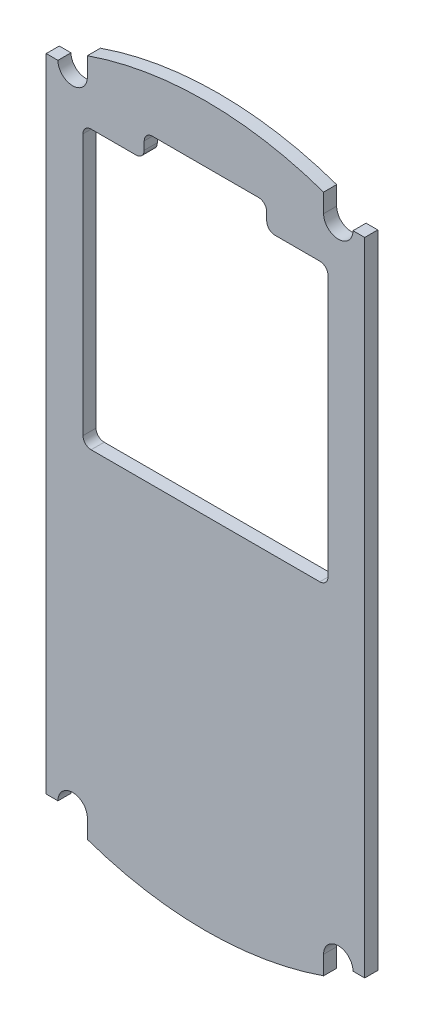
ISO-10303-21;
HEADER;
FILE_DESCRIPTION(('STEP AP214'),'2;1');
FILE_NAME('part.step','',(''),(''),'','','');
FILE_SCHEMA(('AUTOMOTIVE_DESIGN { 1 0 10303 214 1 1 1 1 }'));
ENDSEC;
DATA;
#1=APPLICATION_CONTEXT('core data for automotive mechanical design processes');
#2=APPLICATION_PROTOCOL_DEFINITION('international standard','automotive_design',2000,#1);
#3=PRODUCT_CONTEXT('',#1,'mechanical');
#4=PRODUCT('Part','Part','',(#3));
#5=PRODUCT_RELATED_PRODUCT_CATEGORY('part','',(#4));
#6=PRODUCT_DEFINITION_FORMATION('','',#4);
#7=PRODUCT_DEFINITION_CONTEXT('part definition',#1,'design');
#8=PRODUCT_DEFINITION('design','',#6,#7);
#9=PRODUCT_DEFINITION_SHAPE('','',#8);
#10=(LENGTH_UNIT() NAMED_UNIT(*) SI_UNIT(.MILLI.,.METRE.));
#11=(NAMED_UNIT(*) PLANE_ANGLE_UNIT() SI_UNIT($,.RADIAN.));
#12=(NAMED_UNIT(*) SI_UNIT($,.STERADIAN.) SOLID_ANGLE_UNIT());
#13=UNCERTAINTY_MEASURE_WITH_UNIT(LENGTH_MEASURE(1.E-05),#10,'distance_accuracy_value','');
#14=(GEOMETRIC_REPRESENTATION_CONTEXT(3) GLOBAL_UNCERTAINTY_ASSIGNED_CONTEXT((#13)) GLOBAL_UNIT_ASSIGNED_CONTEXT((#10,
#11,#12)) REPRESENTATION_CONTEXT('',''));
#15=CARTESIAN_POINT('',(0.,0.,0.));
#16=DIRECTION('',(0.,0.,1.));
#17=DIRECTION('',(1.,0.,0.));
#18=AXIS2_PLACEMENT_3D('',#15,#16,#17);
#19=CARTESIAN_POINT('',(19.5,0.,1.6));
#20=DIRECTION('',(-1.,0.,0.));
#21=DIRECTION('',(0.,0.,1.));
#22=AXIS2_PLACEMENT_3D('',#19,#20,#21);
#23=PLANE('',#22);
#24=DIRECTION('',(0.,1.,0.));
#25=VECTOR('',#24,1.);
#26=CARTESIAN_POINT('',(19.5,0.,0.));
#27=LINE('',#26,#25);
#28=CARTESIAN_POINT('',(19.5,-39.2648801317297,0.));
#29=VERTEX_POINT('',#28);
#30=CARTESIAN_POINT('',(19.5,39.2648801317297,0.));
#31=VERTEX_POINT('',#30);
#32=EDGE_CURVE('E267',#29,#31,#27,.T.);
#33=ORIENTED_EDGE('',*,*,#32,.T.);
#34=DIRECTION('',(0.,0.,-1.));
#35=VECTOR('',#34,1.);
#36=CARTESIAN_POINT('',(19.5,39.2648801317297,1.6));
#37=LINE('',#36,#35);
#38=CARTESIAN_POINT('',(19.5,39.2648801317297,1.6));
#39=VERTEX_POINT('',#38);
#40=EDGE_CURVE('E266',#39,#31,#37,.T.);
#41=ORIENTED_EDGE('',*,*,#40,.F.);
#42=DIRECTION('',(0.,1.,0.));
#43=VECTOR('',#42,1.);
#44=CARTESIAN_POINT('',(19.5,0.,1.6));
#45=LINE('',#44,#43);
#46=CARTESIAN_POINT('',(19.5,-39.2648801317297,1.6));
#47=VERTEX_POINT('',#46);
#48=EDGE_CURVE('E251',#47,#39,#45,.T.);
#49=ORIENTED_EDGE('',*,*,#48,.F.);
#50=DIRECTION('',(0.,0.,-1.));
#51=VECTOR('',#50,1.);
#52=CARTESIAN_POINT('',(19.5,-39.2648801317297,1.6));
#53=LINE('',#52,#51);
#54=EDGE_CURVE('E325',#47,#29,#53,.T.);
#55=ORIENTED_EDGE('',*,*,#54,.T.);
#56=EDGE_LOOP('',(#33,#41,#49,#55));
#57=FACE_BOUND('',#56,.T.);
#58=ADVANCED_FACE('F42',(#57),#23,.F.);
#59=CARTESIAN_POINT('',(18.0640458755163,39.2648801317297,1.6));
#60=DIRECTION('',(0.,-1.,0.));
#61=DIRECTION('',(1.,0.,0.));
#62=AXIS2_PLACEMENT_3D('',#59,#60,#61);
#63=PLANE('',#62);
#64=DIRECTION('',(-1.,0.,0.));
#65=VECTOR('',#64,1.);
#66=CARTESIAN_POINT('',(18.0640458755163,39.2648801317297,0.));
#67=LINE('',#66,#65);
#68=CARTESIAN_POINT('',(18.0640458755163,39.2648801317297,0.));
#69=VERTEX_POINT('',#68);
#70=EDGE_CURVE('E328',#31,#69,#67,.T.);
#71=ORIENTED_EDGE('',*,*,#70,.T.);
#72=DIRECTION('',(0.,0.,-1.));
#73=VECTOR('',#72,1.);
#74=CARTESIAN_POINT('',(18.0640458755163,39.2648801317297,1.6));
#75=LINE('',#74,#73);
#76=CARTESIAN_POINT('',(18.0640458755163,39.2648801317297,1.6));
#77=VERTEX_POINT('',#76);
#78=EDGE_CURVE('E272',#77,#69,#75,.T.);
#79=ORIENTED_EDGE('',*,*,#78,.F.);
#80=DIRECTION('',(-1.,0.,0.));
#81=VECTOR('',#80,1.);
#82=CARTESIAN_POINT('',(18.0640458755163,39.2648801317297,1.6));
#83=LINE('',#82,#81);
#84=EDGE_CURVE('E255',#39,#77,#83,.T.);
#85=ORIENTED_EDGE('',*,*,#84,.F.);
#86=ORIENTED_EDGE('',*,*,#40,.T.);
#87=EDGE_LOOP('',(#71,#79,#85,#86));
#88=FACE_BOUND('',#87,.T.);
#89=ADVANCED_FACE('F274',(#88),#63,.F.);
#90=CARTESIAN_POINT('',(16.2640458755163,39.2648801317297,1.6));
#91=DIRECTION('',(0.,0.,-1.));
#92=DIRECTION('',(-1.,0.,0.));
#93=AXIS2_PLACEMENT_3D('',#90,#91,#92);
#94=CYLINDRICAL_SURFACE('',#93,1.8);
#95=CARTESIAN_POINT('',(16.2640458755163,39.2648801317297,0.));
#96=DIRECTION('',(0.,0.,-1.));
#97=DIRECTION('',(-1.,0.,0.));
#98=AXIS2_PLACEMENT_3D('',#95,#96,#97);
#99=CIRCLE('',#98,1.8);
#100=CARTESIAN_POINT('',(14.4640458755163,39.2648801317297,0.));
#101=VERTEX_POINT('',#100);
#102=EDGE_CURVE('E332',#69,#101,#99,.T.);
#103=ORIENTED_EDGE('',*,*,#102,.T.);
#104=DIRECTION('',(0.,0.,-1.));
#105=VECTOR('',#104,1.);
#106=CARTESIAN_POINT('',(14.4640458755163,39.2648801317297,1.6));
#107=LINE('',#106,#105);
#108=CARTESIAN_POINT('',(14.4640458755163,39.2648801317297,1.6));
#109=VERTEX_POINT('',#108);
#110=EDGE_CURVE('E424',#109,#101,#107,.T.);
#111=ORIENTED_EDGE('',*,*,#110,.F.);
#112=CARTESIAN_POINT('',(16.2640458755163,39.2648801317297,1.6));
#113=DIRECTION('',(0.,0.,-1.));
#114=DIRECTION('',(-1.,0.,0.));
#115=AXIS2_PLACEMENT_3D('',#112,#113,#114);
#116=CIRCLE('',#115,1.8);
#117=EDGE_CURVE('E278',#77,#109,#116,.T.);
#118=ORIENTED_EDGE('',*,*,#117,.F.);
#119=ORIENTED_EDGE('',*,*,#78,.T.);
#120=EDGE_LOOP('',(#103,#111,#118,#119));
#121=FACE_BOUND('',#120,.T.);
#122=ADVANCED_FACE('F749',(#121),#94,.F.);
#123=CARTESIAN_POINT('',(14.4640458755163,41.554679362389,1.6));
#124=DIRECTION('',(-1.,0.,0.));
#125=DIRECTION('',(0.,0.,1.));
#126=AXIS2_PLACEMENT_3D('',#123,#124,#125);
#127=PLANE('',#126);
#128=DIRECTION('',(0.,1.,0.));
#129=VECTOR('',#128,1.);
#130=CARTESIAN_POINT('',(14.4640458755163,41.554679362389,0.));
#131=LINE('',#130,#129);
#132=CARTESIAN_POINT('',(14.4640458755163,41.554679362389,0.));
#133=VERTEX_POINT('',#132);
#134=EDGE_CURVE('E335',#101,#133,#131,.T.);
#135=ORIENTED_EDGE('',*,*,#134,.T.);
#136=DIRECTION('',(0.,0.,-1.));
#137=VECTOR('',#136,1.);
#138=CARTESIAN_POINT('',(14.4640458755163,41.554679362389,1.6));
#139=LINE('',#138,#137);
#140=CARTESIAN_POINT('',(14.4640458755163,41.554679362389,1.6));
#141=VERTEX_POINT('',#140);
#142=EDGE_CURVE('E420',#141,#133,#139,.T.);
#143=ORIENTED_EDGE('',*,*,#142,.F.);
#144=DIRECTION('',(0.,1.,0.));
#145=VECTOR('',#144,1.);
#146=CARTESIAN_POINT('',(14.4640458755163,41.554679362389,1.6));
#147=LINE('',#146,#145);
#148=EDGE_CURVE('E284',#109,#141,#147,.T.);
#149=ORIENTED_EDGE('',*,*,#148,.F.);
#150=ORIENTED_EDGE('',*,*,#110,.T.);
#151=EDGE_LOOP('',(#135,#143,#149,#150));
#152=FACE_BOUND('',#151,.T.);
#153=ADVANCED_FACE('F1023',(#152),#127,.F.);
#154=CARTESIAN_POINT('',(0.,0.,1.6));
#155=DIRECTION('',(0.,0.,-1.));
#156=DIRECTION('',(-1.,0.,0.));
#157=AXIS2_PLACEMENT_3D('',#154,#155,#156);
#158=CYLINDRICAL_SURFACE('',#157,44.);
#159=CARTESIAN_POINT('',(0.,0.,0.));
#160=DIRECTION('',(0.,0.,1.));
#161=DIRECTION('',(1.,0.,0.));
#162=AXIS2_PLACEMENT_3D('',#159,#160,#161);
#163=CIRCLE('',#162,44.);
#164=CARTESIAN_POINT('',(-14.4640458755163,41.554679362389,0.));
#165=VERTEX_POINT('',#164);
#166=EDGE_CURVE('E338',#133,#165,#163,.T.);
#167=ORIENTED_EDGE('',*,*,#166,.T.);
#168=DIRECTION('',(0.,0.,-1.));
#169=VECTOR('',#168,1.);
#170=CARTESIAN_POINT('',(-14.4640458755163,41.554679362389,1.6));
#171=LINE('',#170,#169);
#172=CARTESIAN_POINT('',(-14.4640458755163,41.554679362389,1.6));
#173=VERTEX_POINT('',#172);
#174=EDGE_CURVE('E417',#173,#165,#171,.T.);
#175=ORIENTED_EDGE('',*,*,#174,.F.);
#176=CARTESIAN_POINT('',(0.,0.,1.6));
#177=DIRECTION('',(0.,0.,1.));
#178=DIRECTION('',(1.,0.,0.));
#179=AXIS2_PLACEMENT_3D('',#176,#177,#178);
#180=CIRCLE('',#179,44.);
#181=EDGE_CURVE('E290',#141,#173,#180,.T.);
#182=ORIENTED_EDGE('',*,*,#181,.F.);
#183=ORIENTED_EDGE('',*,*,#142,.T.);
#184=EDGE_LOOP('',(#167,#175,#182,#183));
#185=FACE_BOUND('',#184,.T.);
#186=ADVANCED_FACE('F1012',(#185),#158,.T.);
#187=CARTESIAN_POINT('',(-14.4640458755163,41.554679362389,1.6));
#188=DIRECTION('',(1.,0.,0.));
#189=DIRECTION('',(0.,0.,-1.));
#190=AXIS2_PLACEMENT_3D('',#187,#188,#189);
#191=PLANE('',#190);
#192=DIRECTION('',(0.,-1.,0.));
#193=VECTOR('',#192,1.);
#194=CARTESIAN_POINT('',(-14.4640458755163,41.554679362389,0.));
#195=LINE('',#194,#193);
#196=CARTESIAN_POINT('',(-14.4640458755163,39.2648801317297,0.));
#197=VERTEX_POINT('',#196);
#198=EDGE_CURVE('E341',#165,#197,#195,.T.);
#199=ORIENTED_EDGE('',*,*,#198,.T.);
#200=DIRECTION('',(0.,0.,-1.));
#201=VECTOR('',#200,1.);
#202=CARTESIAN_POINT('',(-14.4640458755163,39.2648801317297,1.6));
#203=LINE('',#202,#201);
#204=CARTESIAN_POINT('',(-14.4640458755163,39.2648801317297,1.6));
#205=VERTEX_POINT('',#204);
#206=EDGE_CURVE('E413',#205,#197,#203,.T.);
#207=ORIENTED_EDGE('',*,*,#206,.F.);
#208=DIRECTION('',(0.,-1.,0.));
#209=VECTOR('',#208,1.);
#210=CARTESIAN_POINT('',(-14.4640458755163,41.554679362389,1.6));
#211=LINE('',#210,#209);
#212=EDGE_CURVE('E293',#173,#205,#211,.T.);
#213=ORIENTED_EDGE('',*,*,#212,.F.);
#214=ORIENTED_EDGE('',*,*,#174,.T.);
#215=EDGE_LOOP('',(#199,#207,#213,#214));
#216=FACE_BOUND('',#215,.T.);
#217=ADVANCED_FACE('F1001',(#216),#191,.F.);
#218=CARTESIAN_POINT('',(-16.2640458755163,39.2648801317297,1.6));
#219=DIRECTION('',(0.,0.,-1.));
#220=DIRECTION('',(-1.,0.,0.));
#221=AXIS2_PLACEMENT_3D('',#218,#219,#220);
#222=CYLINDRICAL_SURFACE('',#221,1.8);
#223=CARTESIAN_POINT('',(-16.2640458755163,39.2648801317297,0.));
#224=DIRECTION('',(0.,0.,-1.));
#225=DIRECTION('',(1.,0.,0.));
#226=AXIS2_PLACEMENT_3D('',#223,#224,#225);
#227=CIRCLE('',#226,1.8);
#228=CARTESIAN_POINT('',(-18.0640458755163,39.2648801317297,0.));
#229=VERTEX_POINT('',#228);
#230=EDGE_CURVE('E344',#197,#229,#227,.T.);
#231=ORIENTED_EDGE('',*,*,#230,.T.);
#232=DIRECTION('',(0.,0.,-1.));
#233=VECTOR('',#232,1.);
#234=CARTESIAN_POINT('',(-18.0640458755163,39.2648801317297,1.6));
#235=LINE('',#234,#233);
#236=CARTESIAN_POINT('',(-18.0640458755163,39.2648801317297,1.6));
#237=VERTEX_POINT('',#236);
#238=EDGE_CURVE('E409',#237,#229,#235,.T.);
#239=ORIENTED_EDGE('',*,*,#238,.F.);
#240=CARTESIAN_POINT('',(-16.2640458755163,39.2648801317297,1.6));
#241=DIRECTION('',(0.,0.,-1.));
#242=DIRECTION('',(1.,0.,0.));
#243=AXIS2_PLACEMENT_3D('',#240,#241,#242);
#244=CIRCLE('',#243,1.8);
#245=EDGE_CURVE('E296',#205,#237,#244,.T.);
#246=ORIENTED_EDGE('',*,*,#245,.F.);
#247=ORIENTED_EDGE('',*,*,#206,.T.);
#248=EDGE_LOOP('',(#231,#239,#246,#247));
#249=FACE_BOUND('',#248,.T.);
#250=ADVANCED_FACE('F990',(#249),#222,.F.);
#251=CARTESIAN_POINT('',(-18.0640458755163,39.2648801317297,1.6));
#252=DIRECTION('',(0.,-1.,0.));
#253=DIRECTION('',(1.,0.,0.));
#254=AXIS2_PLACEMENT_3D('',#251,#252,#253);
#255=PLANE('',#254);
#256=DIRECTION('',(-1.,0.,0.));
#257=VECTOR('',#256,1.);
#258=CARTESIAN_POINT('',(-18.0640458755163,39.2648801317297,0.));
#259=LINE('',#258,#257);
#260=CARTESIAN_POINT('',(-19.5,39.2648801317297,0.));
#261=VERTEX_POINT('',#260);
#262=EDGE_CURVE('E347',#229,#261,#259,.T.);
#263=ORIENTED_EDGE('',*,*,#262,.T.);
#264=DIRECTION('',(0.,0.,-1.));
#265=VECTOR('',#264,1.);
#266=CARTESIAN_POINT('',(-19.5,39.2648801317297,1.6));
#267=LINE('',#266,#265);
#268=CARTESIAN_POINT('',(-19.5,39.2648801317297,1.6));
#269=VERTEX_POINT('',#268);
#270=EDGE_CURVE('E405',#269,#261,#267,.T.);
#271=ORIENTED_EDGE('',*,*,#270,.F.);
#272=DIRECTION('',(-1.,0.,0.));
#273=VECTOR('',#272,1.);
#274=CARTESIAN_POINT('',(-18.0640458755163,39.2648801317297,1.6));
#275=LINE('',#274,#273);
#276=EDGE_CURVE('E299',#237,#269,#275,.T.);
#277=ORIENTED_EDGE('',*,*,#276,.F.);
#278=ORIENTED_EDGE('',*,*,#238,.T.);
#279=EDGE_LOOP('',(#263,#271,#277,#278));
#280=FACE_BOUND('',#279,.T.);
#281=ADVANCED_FACE('F976',(#280),#255,.F.);
#282=CARTESIAN_POINT('',(-19.5,0.,1.6));
#283=DIRECTION('',(1.,0.,0.));
#284=DIRECTION('',(0.,1.,0.));
#285=AXIS2_PLACEMENT_3D('',#282,#283,#284);
#286=PLANE('',#285);
#287=DIRECTION('',(0.,-1.,0.));
#288=VECTOR('',#287,1.);
#289=CARTESIAN_POINT('',(-19.5,0.,0.));
#290=LINE('',#289,#288);
#291=CARTESIAN_POINT('',(-19.5,-39.2648801317297,0.));
#292=VERTEX_POINT('',#291);
#293=EDGE_CURVE('E351',#261,#292,#290,.T.);
#294=ORIENTED_EDGE('',*,*,#293,.T.);
#295=DIRECTION('',(0.,0.,-1.));
#296=VECTOR('',#295,1.);
#297=CARTESIAN_POINT('',(-19.5,-39.2648801317297,1.6));
#298=LINE('',#297,#296);
#299=CARTESIAN_POINT('',(-19.5,-39.2648801317297,1.6));
#300=VERTEX_POINT('',#299);
#301=EDGE_CURVE('E401',#300,#292,#298,.T.);
#302=ORIENTED_EDGE('',*,*,#301,.F.);
#303=DIRECTION('',(0.,-1.,0.));
#304=VECTOR('',#303,1.);
#305=CARTESIAN_POINT('',(-19.5,0.,1.6));
#306=LINE('',#305,#304);
#307=EDGE_CURVE('E302',#269,#300,#306,.T.);
#308=ORIENTED_EDGE('',*,*,#307,.F.);
#309=ORIENTED_EDGE('',*,*,#270,.T.);
#310=EDGE_LOOP('',(#294,#302,#308,#309));
#311=FACE_BOUND('',#310,.T.);
#312=ADVANCED_FACE('F966',(#311),#286,.F.);
#313=CARTESIAN_POINT('',(-18.0640458755163,-39.2648801317297,1.6));
#314=DIRECTION('',(0.,1.,0.));
#315=DIRECTION('',(-1.,0.,0.));
#316=AXIS2_PLACEMENT_3D('',#313,#314,#315);
#317=PLANE('',#316);
#318=DIRECTION('',(1.,0.,0.));
#319=VECTOR('',#318,1.);
#320=CARTESIAN_POINT('',(-18.0640458755163,-39.2648801317297,0.));
#321=LINE('',#320,#319);
#322=CARTESIAN_POINT('',(-18.0640458755163,-39.2648801317297,0.));
#323=VERTEX_POINT('',#322);
#324=EDGE_CURVE('E354',#292,#323,#321,.T.);
#325=ORIENTED_EDGE('',*,*,#324,.T.);
#326=DIRECTION('',(0.,0.,-1.));
#327=VECTOR('',#326,1.);
#328=CARTESIAN_POINT('',(-18.0640458755163,-39.2648801317297,1.6));
#329=LINE('',#328,#327);
#330=CARTESIAN_POINT('',(-18.0640458755163,-39.2648801317297,1.6));
#331=VERTEX_POINT('',#330);
#332=EDGE_CURVE('E397',#331,#323,#329,.T.);
#333=ORIENTED_EDGE('',*,*,#332,.F.);
#334=DIRECTION('',(1.,0.,0.));
#335=VECTOR('',#334,1.);
#336=CARTESIAN_POINT('',(-18.0640458755163,-39.2648801317297,1.6));
#337=LINE('',#336,#335);
#338=EDGE_CURVE('E305',#300,#331,#337,.T.);
#339=ORIENTED_EDGE('',*,*,#338,.F.);
#340=ORIENTED_EDGE('',*,*,#301,.T.);
#341=EDGE_LOOP('',(#325,#333,#339,#340));
#342=FACE_BOUND('',#341,.T.);
#343=ADVANCED_FACE('F956',(#342),#317,.F.);
#344=CARTESIAN_POINT('',(-16.2640458755163,-39.2648801317297,1.6));
#345=DIRECTION('',(0.,0.,-1.));
#346=DIRECTION('',(-1.,0.,0.));
#347=AXIS2_PLACEMENT_3D('',#344,#345,#346);
#348=CYLINDRICAL_SURFACE('',#347,1.8);
#349=CARTESIAN_POINT('',(-16.2640458755163,-39.2648801317297,0.));
#350=DIRECTION('',(0.,0.,-1.));
#351=DIRECTION('',(-1.,0.,0.));
#352=AXIS2_PLACEMENT_3D('',#349,#350,#351);
#353=CIRCLE('',#352,1.8);
#354=CARTESIAN_POINT('',(-14.4640458755163,-39.2648801317297,0.));
#355=VERTEX_POINT('',#354);
#356=EDGE_CURVE('E357',#323,#355,#353,.T.);
#357=ORIENTED_EDGE('',*,*,#356,.T.);
#358=DIRECTION('',(0.,0.,-1.));
#359=VECTOR('',#358,1.);
#360=CARTESIAN_POINT('',(-14.4640458755163,-39.2648801317297,1.6));
#361=LINE('',#360,#359);
#362=CARTESIAN_POINT('',(-14.4640458755163,-39.2648801317297,1.6));
#363=VERTEX_POINT('',#362);
#364=EDGE_CURVE('E393',#363,#355,#361,.T.);
#365=ORIENTED_EDGE('',*,*,#364,.F.);
#366=CARTESIAN_POINT('',(-16.2640458755163,-39.2648801317297,1.6));
#367=DIRECTION('',(0.,0.,-1.));
#368=DIRECTION('',(-1.,0.,0.));
#369=AXIS2_PLACEMENT_3D('',#366,#367,#368);
#370=CIRCLE('',#369,1.8);
#371=EDGE_CURVE('E308',#331,#363,#370,.T.);
#372=ORIENTED_EDGE('',*,*,#371,.F.);
#373=ORIENTED_EDGE('',*,*,#332,.T.);
#374=EDGE_LOOP('',(#357,#365,#372,#373));
#375=FACE_BOUND('',#374,.T.);
#376=ADVANCED_FACE('F946',(#375),#348,.F.);
#377=CARTESIAN_POINT('',(-14.4640458755163,-41.554679362389,1.6));
#378=DIRECTION('',(1.,0.,0.));
#379=DIRECTION('',(0.,0.,-1.));
#380=AXIS2_PLACEMENT_3D('',#377,#378,#379);
#381=PLANE('',#380);
#382=DIRECTION('',(0.,-1.,0.));
#383=VECTOR('',#382,1.);
#384=CARTESIAN_POINT('',(-14.4640458755163,-41.554679362389,0.));
#385=LINE('',#384,#383);
#386=CARTESIAN_POINT('',(-14.4640458755163,-41.554679362389,0.));
#387=VERTEX_POINT('',#386);
#388=EDGE_CURVE('E360',#355,#387,#385,.T.);
#389=ORIENTED_EDGE('',*,*,#388,.T.);
#390=DIRECTION('',(0.,0.,-1.));
#391=VECTOR('',#390,1.);
#392=CARTESIAN_POINT('',(-14.4640458755163,-41.554679362389,1.6));
#393=LINE('',#392,#391);
#394=CARTESIAN_POINT('',(-14.4640458755163,-41.554679362389,1.6));
#395=VERTEX_POINT('',#394);
#396=EDGE_CURVE('E389',#395,#387,#393,.T.);
#397=ORIENTED_EDGE('',*,*,#396,.F.);
#398=DIRECTION('',(0.,-1.,0.));
#399=VECTOR('',#398,1.);
#400=CARTESIAN_POINT('',(-14.4640458755163,-41.554679362389,1.6));
#401=LINE('',#400,#399);
#402=EDGE_CURVE('E311',#363,#395,#401,.T.);
#403=ORIENTED_EDGE('',*,*,#402,.F.);
#404=ORIENTED_EDGE('',*,*,#364,.T.);
#405=EDGE_LOOP('',(#389,#397,#403,#404));
#406=FACE_BOUND('',#405,.T.);
#407=ADVANCED_FACE('F936',(#406),#381,.F.);
#408=CARTESIAN_POINT('',(0.,0.,1.6));
#409=DIRECTION('',(0.,0.,-1.));
#410=DIRECTION('',(-1.,0.,0.));
#411=AXIS2_PLACEMENT_3D('',#408,#409,#410);
#412=CYLINDRICAL_SURFACE('',#411,44.);
#413=CARTESIAN_POINT('',(0.,0.,0.));
#414=DIRECTION('',(0.,0.,1.));
#415=DIRECTION('',(-1.,0.,0.));
#416=AXIS2_PLACEMENT_3D('',#413,#414,#415);
#417=CIRCLE('',#416,44.);
#418=CARTESIAN_POINT('',(14.4640458755164,-41.554679362389,0.));
#419=VERTEX_POINT('',#418);
#420=EDGE_CURVE('E363',#387,#419,#417,.T.);
#421=ORIENTED_EDGE('',*,*,#420,.T.);
#422=DIRECTION('',(0.,0.,-1.));
#423=VECTOR('',#422,1.);
#424=CARTESIAN_POINT('',(14.4640458755164,-41.554679362389,1.6));
#425=LINE('',#424,#423);
#426=CARTESIAN_POINT('',(14.4640458755164,-41.554679362389,1.6));
#427=VERTEX_POINT('',#426);
#428=EDGE_CURVE('E385',#427,#419,#425,.T.);
#429=ORIENTED_EDGE('',*,*,#428,.F.);
#430=CARTESIAN_POINT('',(0.,0.,1.6));
#431=DIRECTION('',(0.,0.,1.));
#432=DIRECTION('',(-1.,0.,0.));
#433=AXIS2_PLACEMENT_3D('',#430,#431,#432);
#434=CIRCLE('',#433,44.);
#435=EDGE_CURVE('E314',#395,#427,#434,.T.);
#436=ORIENTED_EDGE('',*,*,#435,.F.);
#437=ORIENTED_EDGE('',*,*,#396,.T.);
#438=EDGE_LOOP('',(#421,#429,#436,#437));
#439=FACE_BOUND('',#438,.T.);
#440=ADVANCED_FACE('F926',(#439),#412,.T.);
#441=CARTESIAN_POINT('',(14.4640458755164,-41.554679362389,1.6));
#442=DIRECTION('',(-1.,0.,0.));
#443=DIRECTION('',(0.,0.,1.));
#444=AXIS2_PLACEMENT_3D('',#441,#442,#443);
#445=PLANE('',#444);
#446=DIRECTION('',(0.,1.,0.));
#447=VECTOR('',#446,1.);
#448=CARTESIAN_POINT('',(14.4640458755164,-41.554679362389,0.));
#449=LINE('',#448,#447);
#450=CARTESIAN_POINT('',(14.4640458755164,-39.2648801317297,0.));
#451=VERTEX_POINT('',#450);
#452=EDGE_CURVE('E366',#419,#451,#449,.T.);
#453=ORIENTED_EDGE('',*,*,#452,.T.);
#454=DIRECTION('',(0.,0.,-1.));
#455=VECTOR('',#454,1.);
#456=CARTESIAN_POINT('',(14.4640458755164,-39.2648801317297,1.6));
#457=LINE('',#456,#455);
#458=CARTESIAN_POINT('',(14.4640458755164,-39.2648801317297,1.6));
#459=VERTEX_POINT('',#458);
#460=EDGE_CURVE('E381',#459,#451,#457,.T.);
#461=ORIENTED_EDGE('',*,*,#460,.F.);
#462=DIRECTION('',(0.,1.,0.));
#463=VECTOR('',#462,1.);
#464=CARTESIAN_POINT('',(14.4640458755164,-41.554679362389,1.6));
#465=LINE('',#464,#463);
#466=EDGE_CURVE('E317',#427,#459,#465,.T.);
#467=ORIENTED_EDGE('',*,*,#466,.F.);
#468=ORIENTED_EDGE('',*,*,#428,.T.);
#469=EDGE_LOOP('',(#453,#461,#467,#468));
#470=FACE_BOUND('',#469,.T.);
#471=ADVANCED_FACE('F916',(#470),#445,.F.);
#472=CARTESIAN_POINT('',(16.2640458755163,-39.2648801317297,1.6));
#473=DIRECTION('',(0.,0.,-1.));
#474=DIRECTION('',(-1.,0.,0.));
#475=AXIS2_PLACEMENT_3D('',#472,#473,#474);
#476=CYLINDRICAL_SURFACE('',#475,1.8);
#477=CARTESIAN_POINT('',(16.2640458755163,-39.2648801317297,0.));
#478=DIRECTION('',(0.,0.,-1.));
#479=DIRECTION('',(1.,0.,0.));
#480=AXIS2_PLACEMENT_3D('',#477,#478,#479);
#481=CIRCLE('',#480,1.8);
#482=CARTESIAN_POINT('',(18.0640458755163,-39.2648801317297,0.));
#483=VERTEX_POINT('',#482);
#484=EDGE_CURVE('E369',#451,#483,#481,.T.);
#485=ORIENTED_EDGE('',*,*,#484,.T.);
#486=DIRECTION('',(0.,0.,-1.));
#487=VECTOR('',#486,1.);
#488=CARTESIAN_POINT('',(18.0640458755163,-39.2648801317297,1.6));
#489=LINE('',#488,#487);
#490=CARTESIAN_POINT('',(18.0640458755163,-39.2648801317297,1.6));
#491=VERTEX_POINT('',#490);
#492=EDGE_CURVE('E377',#491,#483,#489,.T.);
#493=ORIENTED_EDGE('',*,*,#492,.F.);
#494=CARTESIAN_POINT('',(16.2640458755163,-39.2648801317297,1.6));
#495=DIRECTION('',(0.,0.,-1.));
#496=DIRECTION('',(1.,0.,0.));
#497=AXIS2_PLACEMENT_3D('',#494,#495,#496);
#498=CIRCLE('',#497,1.8);
#499=EDGE_CURVE('E320',#459,#491,#498,.T.);
#500=ORIENTED_EDGE('',*,*,#499,.F.);
#501=ORIENTED_EDGE('',*,*,#460,.T.);
#502=EDGE_LOOP('',(#485,#493,#500,#501));
#503=FACE_BOUND('',#502,.T.);
#504=ADVANCED_FACE('F907',(#503),#476,.F.);
#505=CARTESIAN_POINT('',(18.0640458755163,-39.2648801317297,1.6));
#506=DIRECTION('',(0.,1.,0.));
#507=DIRECTION('',(-1.,0.,0.));
#508=AXIS2_PLACEMENT_3D('',#505,#506,#507);
#509=PLANE('',#508);
#510=DIRECTION('',(1.,0.,0.));
#511=VECTOR('',#510,1.);
#512=CARTESIAN_POINT('',(18.0640458755163,-39.2648801317297,0.));
#513=LINE('',#512,#511);
#514=EDGE_CURVE('E263',#483,#29,#513,.T.);
#515=ORIENTED_EDGE('',*,*,#514,.T.);
#516=ORIENTED_EDGE('',*,*,#54,.F.);
#517=DIRECTION('',(1.,0.,0.));
#518=VECTOR('',#517,1.);
#519=CARTESIAN_POINT('',(18.0640458755163,-39.2648801317297,1.6));
#520=LINE('',#519,#518);
#521=EDGE_CURVE('E258',#491,#47,#520,.T.);
#522=ORIENTED_EDGE('',*,*,#521,.F.);
#523=ORIENTED_EDGE('',*,*,#492,.T.);
#524=EDGE_LOOP('',(#515,#516,#522,#523));
#525=FACE_BOUND('',#524,.T.);
#526=ADVANCED_FACE('F897',(#525),#509,.F.);
#527=CARTESIAN_POINT('',(16.2640458755163,-39.2648801317297,1.6));
#528=DIRECTION('',(0.,0.,1.));
#529=DIRECTION('',(1.,0.,0.));
#530=AXIS2_PLACEMENT_3D('',#527,#528,#529);
#531=PLANE('',#530);
#532=DIRECTION('',(0.,1.,0.));
#533=VECTOR('',#532,1.);
#534=CARTESIAN_POINT('',(7.5,34.,1.6));
#535=LINE('',#534,#533);
#536=CARTESIAN_POINT('',(7.5,35.,1.6));
#537=VERTEX_POINT('',#536);
#538=CARTESIAN_POINT('',(7.5,36.,1.6));
#539=VERTEX_POINT('',#538);
#540=EDGE_CURVE('E616',#537,#539,#535,.T.);
#541=ORIENTED_EDGE('',*,*,#540,.F.);
#542=CARTESIAN_POINT('',(8.5,35.,1.6));
#543=DIRECTION('',(0.,0.,1.));
#544=DIRECTION('',(1.,0.,0.));
#545=AXIS2_PLACEMENT_3D('',#542,#543,#544);
#546=CIRCLE('',#545,1.);
#547=CARTESIAN_POINT('',(8.5,34.,1.6));
#548=VERTEX_POINT('',#547);
#549=EDGE_CURVE('E490',#537,#548,#546,.T.);
#550=ORIENTED_EDGE('',*,*,#549,.T.);
#551=DIRECTION('',(-1.,0.,0.));
#552=VECTOR('',#551,1.);
#553=CARTESIAN_POINT('',(7.5,34.,1.6));
#554=LINE('',#553,#552);
#555=CARTESIAN_POINT('',(14.,34.,1.6));
#556=VERTEX_POINT('',#555);
#557=EDGE_CURVE('E329',#556,#548,#554,.T.);
#558=ORIENTED_EDGE('',*,*,#557,.F.);
#559=CARTESIAN_POINT('',(14.,33.,1.6));
#560=DIRECTION('',(0.,0.,1.));
#561=DIRECTION('',(1.,0.,0.));
#562=AXIS2_PLACEMENT_3D('',#559,#560,#561);
#563=CIRCLE('',#562,1.);
#564=CARTESIAN_POINT('',(15.,33.,1.6));
#565=VERTEX_POINT('',#564);
#566=EDGE_CURVE('E531',#556,#565,#563,.F.);
#567=ORIENTED_EDGE('',*,*,#566,.T.);
#568=DIRECTION('',(0.,1.,0.));
#569=VECTOR('',#568,1.);
#570=CARTESIAN_POINT('',(15.,0.,1.6));
#571=LINE('',#570,#569);
#572=CARTESIAN_POINT('',(15.,1.,1.6));
#573=VERTEX_POINT('',#572);
#574=EDGE_CURVE('E589',#573,#565,#571,.T.);
#575=ORIENTED_EDGE('',*,*,#574,.F.);
#576=CARTESIAN_POINT('',(14.,1.,1.6));
#577=DIRECTION('',(0.,0.,1.));
#578=DIRECTION('',(1.,0.,0.));
#579=AXIS2_PLACEMENT_3D('',#576,#577,#578);
#580=CIRCLE('',#579,1.);
#581=CARTESIAN_POINT('',(14.,0.,1.6));
#582=VERTEX_POINT('',#581);
#583=EDGE_CURVE('E525',#573,#582,#580,.F.);
#584=ORIENTED_EDGE('',*,*,#583,.T.);
#585=DIRECTION('',(1.,0.,0.));
#586=VECTOR('',#585,1.);
#587=CARTESIAN_POINT('',(-15.,0.,1.6));
#588=LINE('',#587,#586);
#589=CARTESIAN_POINT('',(-14.,0.,1.6));
#590=VERTEX_POINT('',#589);
#591=EDGE_CURVE('E585',#590,#582,#588,.T.);
#592=ORIENTED_EDGE('',*,*,#591,.F.);
#593=CARTESIAN_POINT('',(-14.,1.,1.6));
#594=DIRECTION('',(0.,0.,1.));
#595=DIRECTION('',(1.,0.,0.));
#596=AXIS2_PLACEMENT_3D('',#593,#594,#595);
#597=CIRCLE('',#596,1.);
#598=CARTESIAN_POINT('',(-15.,1.,1.6));
#599=VERTEX_POINT('',#598);
#600=EDGE_CURVE('E549',#590,#599,#597,.F.);
#601=ORIENTED_EDGE('',*,*,#600,.T.);
#602=DIRECTION('',(0.,-1.,0.));
#603=VECTOR('',#602,1.);
#604=CARTESIAN_POINT('',(-15.,0.,1.6));
#605=LINE('',#604,#603);
#606=CARTESIAN_POINT('',(-15.,33.,1.6));
#607=VERTEX_POINT('',#606);
#608=EDGE_CURVE('E562',#607,#599,#605,.T.);
#609=ORIENTED_EDGE('',*,*,#608,.F.);
#610=CARTESIAN_POINT('',(-14.,33.,1.6));
#611=DIRECTION('',(0.,0.,1.));
#612=DIRECTION('',(1.,0.,0.));
#613=AXIS2_PLACEMENT_3D('',#610,#611,#612);
#614=CIRCLE('',#613,1.);
#615=CARTESIAN_POINT('',(-14.,34.,1.6));
#616=VERTEX_POINT('',#615);
#617=EDGE_CURVE('E51',#607,#616,#614,.F.);
#618=ORIENTED_EDGE('',*,*,#617,.T.);
#619=DIRECTION('',(-1.,0.,0.));
#620=VECTOR('',#619,1.);
#621=CARTESIAN_POINT('',(-7.5,34.,1.6));
#622=LINE('',#621,#620);
#623=CARTESIAN_POINT('',(-8.5,34.,1.6));
#624=VERTEX_POINT('',#623);
#625=EDGE_CURVE('E561',#624,#616,#622,.T.);
#626=ORIENTED_EDGE('',*,*,#625,.F.);
#627=CARTESIAN_POINT('',(-8.5,35.,1.6));
#628=DIRECTION('',(0.,0.,1.));
#629=DIRECTION('',(1.,0.,0.));
#630=AXIS2_PLACEMENT_3D('',#627,#628,#629);
#631=CIRCLE('',#630,1.);
#632=CARTESIAN_POINT('',(-7.5,35.,1.6));
#633=VERTEX_POINT('',#632);
#634=EDGE_CURVE('E487',#624,#633,#631,.T.);
#635=ORIENTED_EDGE('',*,*,#634,.T.);
#636=DIRECTION('',(0.,-1.,0.));
#637=VECTOR('',#636,1.);
#638=CARTESIAN_POINT('',(-7.5,34.,1.6));
#639=LINE('',#638,#637);
#640=CARTESIAN_POINT('',(-7.5,36.,1.6));
#641=VERTEX_POINT('',#640);
#642=EDGE_CURVE('E571',#641,#633,#639,.T.);
#643=ORIENTED_EDGE('',*,*,#642,.F.);
#644=CARTESIAN_POINT('',(-6.5,36.,1.6));
#645=DIRECTION('',(0.,0.,1.));
#646=DIRECTION('',(1.,0.,0.));
#647=AXIS2_PLACEMENT_3D('',#644,#645,#646);
#648=CIRCLE('',#647,1.);
#649=CARTESIAN_POINT('',(-6.5,37.,1.6));
#650=VERTEX_POINT('',#649);
#651=EDGE_CURVE('E543',#641,#650,#648,.F.);
#652=ORIENTED_EDGE('',*,*,#651,.T.);
#653=DIRECTION('',(-1.,0.,0.));
#654=VECTOR('',#653,1.);
#655=CARTESIAN_POINT('',(7.5,37.,1.6));
#656=LINE('',#655,#654);
#657=CARTESIAN_POINT('',(6.5,37.,1.6));
#658=VERTEX_POINT('',#657);
#659=EDGE_CURVE('E627',#658,#650,#656,.T.);
#660=ORIENTED_EDGE('',*,*,#659,.F.);
#661=CARTESIAN_POINT('',(6.5,36.,1.6));
#662=DIRECTION('',(0.,0.,1.));
#663=DIRECTION('',(1.,0.,0.));
#664=AXIS2_PLACEMENT_3D('',#661,#662,#663);
#665=CIRCLE('',#664,1.);
#666=EDGE_CURVE('E537',#658,#539,#665,.F.);
#667=ORIENTED_EDGE('',*,*,#666,.T.);
#668=EDGE_LOOP('',(#541,#550,#558,#567,#575,#584,#592,#601,#609,#618,#626,#635,#643,#652,#660,#667));
#669=FACE_BOUND('',#668,.T.);
#670=ORIENTED_EDGE('',*,*,#48,.T.);
#671=ORIENTED_EDGE('',*,*,#84,.T.);
#672=ORIENTED_EDGE('',*,*,#117,.T.);
#673=ORIENTED_EDGE('',*,*,#148,.T.);
#674=ORIENTED_EDGE('',*,*,#181,.T.);
#675=ORIENTED_EDGE('',*,*,#212,.T.);
#676=ORIENTED_EDGE('',*,*,#245,.T.);
#677=ORIENTED_EDGE('',*,*,#276,.T.);
#678=ORIENTED_EDGE('',*,*,#307,.T.);
#679=ORIENTED_EDGE('',*,*,#338,.T.);
#680=ORIENTED_EDGE('',*,*,#371,.T.);
#681=ORIENTED_EDGE('',*,*,#402,.T.);
#682=ORIENTED_EDGE('',*,*,#435,.T.);
#683=ORIENTED_EDGE('',*,*,#466,.T.);
#684=ORIENTED_EDGE('',*,*,#499,.T.);
#685=ORIENTED_EDGE('',*,*,#521,.T.);
#686=EDGE_LOOP('',(#670,#671,#672,#673,#674,#675,#676,#677,#678,#679,#680,#681,#682,#683,#684,#685));
#687=FACE_BOUND('',#686,.T.);
#688=ADVANCED_FACE('F253',(#669,#687),#531,.T.);
#689=CARTESIAN_POINT('',(16.2640458755163,-39.2648801317297,0.));
#690=DIRECTION('',(0.,0.,1.));
#691=DIRECTION('',(1.,0.,0.));
#692=AXIS2_PLACEMENT_3D('',#689,#690,#691);
#693=PLANE('',#692);
#694=DIRECTION('',(-1.,0.,0.));
#695=VECTOR('',#694,1.);
#696=CARTESIAN_POINT('',(16.2640458755163,34.,0.));
#697=LINE('',#696,#695);
#698=CARTESIAN_POINT('',(14.,34.,0.));
#699=VERTEX_POINT('',#698);
#700=CARTESIAN_POINT('',(8.5,34.,0.));
#701=VERTEX_POINT('',#700);
#702=EDGE_CURVE('E451',#699,#701,#697,.T.);
#703=ORIENTED_EDGE('',*,*,#702,.T.);
#704=CARTESIAN_POINT('',(8.5,35.,0.));
#705=DIRECTION('',(0.,0.,1.));
#706=DIRECTION('',(1.,0.,0.));
#707=AXIS2_PLACEMENT_3D('',#704,#705,#706);
#708=CIRCLE('',#707,1.);
#709=CARTESIAN_POINT('',(7.5,35.,0.));
#710=VERTEX_POINT('',#709);
#711=EDGE_CURVE('E495',#701,#710,#708,.F.);
#712=ORIENTED_EDGE('',*,*,#711,.T.);
#713=DIRECTION('',(0.,1.,0.));
#714=VECTOR('',#713,1.);
#715=CARTESIAN_POINT('',(7.5,-39.2648801317297,0.));
#716=LINE('',#715,#714);
#717=CARTESIAN_POINT('',(7.5,36.,0.));
#718=VERTEX_POINT('',#717);
#719=EDGE_CURVE('E455',#710,#718,#716,.T.);
#720=ORIENTED_EDGE('',*,*,#719,.T.);
#721=CARTESIAN_POINT('',(6.5,36.,0.));
#722=DIRECTION('',(0.,0.,1.));
#723=DIRECTION('',(1.,0.,0.));
#724=AXIS2_PLACEMENT_3D('',#721,#722,#723);
#725=CIRCLE('',#724,1.);
#726=CARTESIAN_POINT('',(6.5,37.,0.));
#727=VERTEX_POINT('',#726);
#728=EDGE_CURVE('E540',#718,#727,#725,.T.);
#729=ORIENTED_EDGE('',*,*,#728,.T.);
#730=DIRECTION('',(-1.,0.,0.));
#731=VECTOR('',#730,1.);
#732=CARTESIAN_POINT('',(16.2640458755163,37.,0.));
#733=LINE('',#732,#731);
#734=CARTESIAN_POINT('',(-6.5,37.,0.));
#735=VERTEX_POINT('',#734);
#736=EDGE_CURVE('E271',#727,#735,#733,.T.);
#737=ORIENTED_EDGE('',*,*,#736,.T.);
#738=CARTESIAN_POINT('',(-6.5,36.,0.));
#739=DIRECTION('',(0.,0.,1.));
#740=DIRECTION('',(1.,0.,0.));
#741=AXIS2_PLACEMENT_3D('',#738,#739,#740);
#742=CIRCLE('',#741,1.);
#743=CARTESIAN_POINT('',(-7.5,36.,0.));
#744=VERTEX_POINT('',#743);
#745=EDGE_CURVE('E546',#735,#744,#742,.T.);
#746=ORIENTED_EDGE('',*,*,#745,.T.);
#747=DIRECTION('',(0.,-1.,0.));
#748=VECTOR('',#747,1.);
#749=CARTESIAN_POINT('',(-7.5,-39.2648801317297,0.));
#750=LINE('',#749,#748);
#751=CARTESIAN_POINT('',(-7.5,35.,0.));
#752=VERTEX_POINT('',#751);
#753=EDGE_CURVE('E433',#744,#752,#750,.T.);
#754=ORIENTED_EDGE('',*,*,#753,.T.);
#755=CARTESIAN_POINT('',(-8.5,35.,0.));
#756=DIRECTION('',(0.,0.,1.));
#757=DIRECTION('',(1.,0.,0.));
#758=AXIS2_PLACEMENT_3D('',#755,#756,#757);
#759=CIRCLE('',#758,1.);
#760=CARTESIAN_POINT('',(-8.5,34.,0.));
#761=VERTEX_POINT('',#760);
#762=EDGE_CURVE('E493',#752,#761,#759,.F.);
#763=ORIENTED_EDGE('',*,*,#762,.T.);
#764=DIRECTION('',(-1.,0.,0.));
#765=VECTOR('',#764,1.);
#766=CARTESIAN_POINT('',(16.2640458755163,34.,0.));
#767=LINE('',#766,#765);
#768=CARTESIAN_POINT('',(-14.,34.,0.));
#769=VERTEX_POINT('',#768);
#770=EDGE_CURVE('E437',#761,#769,#767,.T.);
#771=ORIENTED_EDGE('',*,*,#770,.T.);
#772=CARTESIAN_POINT('',(-14.,33.,0.));
#773=DIRECTION('',(0.,0.,1.));
#774=DIRECTION('',(1.,0.,0.));
#775=AXIS2_PLACEMENT_3D('',#772,#773,#774);
#776=CIRCLE('',#775,1.);
#777=CARTESIAN_POINT('',(-15.,33.,0.));
#778=VERTEX_POINT('',#777);
#779=EDGE_CURVE('E11',#769,#778,#776,.T.);
#780=ORIENTED_EDGE('',*,*,#779,.T.);
#781=DIRECTION('',(0.,-1.,0.));
#782=VECTOR('',#781,1.);
#783=CARTESIAN_POINT('',(-15.,-39.2648801317297,0.));
#784=LINE('',#783,#782);
#785=CARTESIAN_POINT('',(-15.,1.,0.));
#786=VERTEX_POINT('',#785);
#787=EDGE_CURVE('E440',#778,#786,#784,.T.);
#788=ORIENTED_EDGE('',*,*,#787,.T.);
#789=CARTESIAN_POINT('',(-14.,1.,0.));
#790=DIRECTION('',(0.,0.,1.));
#791=DIRECTION('',(1.,0.,0.));
#792=AXIS2_PLACEMENT_3D('',#789,#790,#791);
#793=CIRCLE('',#792,1.);
#794=CARTESIAN_POINT('',(-14.,0.,0.));
#795=VERTEX_POINT('',#794);
#796=EDGE_CURVE('E552',#786,#795,#793,.T.);
#797=ORIENTED_EDGE('',*,*,#796,.T.);
#798=DIRECTION('',(1.,0.,0.));
#799=VECTOR('',#798,1.);
#800=CARTESIAN_POINT('',(16.2640458755163,0.,0.));
#801=LINE('',#800,#799);
#802=CARTESIAN_POINT('',(14.,0.,0.));
#803=VERTEX_POINT('',#802);
#804=EDGE_CURVE('E443',#795,#803,#801,.T.);
#805=ORIENTED_EDGE('',*,*,#804,.T.);
#806=CARTESIAN_POINT('',(14.,1.,0.));
#807=DIRECTION('',(0.,0.,1.));
#808=DIRECTION('',(1.,0.,0.));
#809=AXIS2_PLACEMENT_3D('',#806,#807,#808);
#810=CIRCLE('',#809,1.);
#811=CARTESIAN_POINT('',(15.,1.,0.));
#812=VERTEX_POINT('',#811);
#813=EDGE_CURVE('E528',#803,#812,#810,.T.);
#814=ORIENTED_EDGE('',*,*,#813,.T.);
#815=DIRECTION('',(0.,1.,0.));
#816=VECTOR('',#815,1.);
#817=CARTESIAN_POINT('',(15.,-39.2648801317297,0.));
#818=LINE('',#817,#816);
#819=CARTESIAN_POINT('',(15.,33.,0.));
#820=VERTEX_POINT('',#819);
#821=EDGE_CURVE('E447',#812,#820,#818,.T.);
#822=ORIENTED_EDGE('',*,*,#821,.T.);
#823=CARTESIAN_POINT('',(14.,33.,0.));
#824=DIRECTION('',(0.,0.,1.));
#825=DIRECTION('',(1.,0.,0.));
#826=AXIS2_PLACEMENT_3D('',#823,#824,#825);
#827=CIRCLE('',#826,1.);
#828=EDGE_CURVE('E534',#820,#699,#827,.T.);
#829=ORIENTED_EDGE('',*,*,#828,.T.);
#830=EDGE_LOOP('',(#703,#712,#720,#729,#737,#746,#754,#763,#771,#780,#788,#797,#805,#814,#822,#829));
#831=FACE_BOUND('',#830,.T.);
#832=ORIENTED_EDGE('',*,*,#32,.F.);
#833=ORIENTED_EDGE('',*,*,#514,.F.);
#834=ORIENTED_EDGE('',*,*,#484,.F.);
#835=ORIENTED_EDGE('',*,*,#452,.F.);
#836=ORIENTED_EDGE('',*,*,#420,.F.);
#837=ORIENTED_EDGE('',*,*,#388,.F.);
#838=ORIENTED_EDGE('',*,*,#356,.F.);
#839=ORIENTED_EDGE('',*,*,#324,.F.);
#840=ORIENTED_EDGE('',*,*,#293,.F.);
#841=ORIENTED_EDGE('',*,*,#262,.F.);
#842=ORIENTED_EDGE('',*,*,#230,.F.);
#843=ORIENTED_EDGE('',*,*,#198,.F.);
#844=ORIENTED_EDGE('',*,*,#166,.F.);
#845=ORIENTED_EDGE('',*,*,#134,.F.);
#846=ORIENTED_EDGE('',*,*,#102,.F.);
#847=ORIENTED_EDGE('',*,*,#70,.F.);
#848=EDGE_LOOP('',(#832,#833,#834,#835,#836,#837,#838,#839,#840,#841,#842,#843,#844,#845,#846,#847));
#849=FACE_BOUND('',#848,.T.);
#850=ADVANCED_FACE('F575',(#831,#849),#693,.F.);
#851=CARTESIAN_POINT('',(7.5,34.,-8.4));
#852=DIRECTION('',(1.,0.,0.));
#853=DIRECTION('',(0.,0.,-1.));
#854=AXIS2_PLACEMENT_3D('',#851,#852,#853);
#855=PLANE('',#854);
#856=ORIENTED_EDGE('',*,*,#719,.F.);
#857=DIRECTION('',(0.,0.,1.));
#858=VECTOR('',#857,1.);
#859=CARTESIAN_POINT('',(7.5,35.,-8.4));
#860=LINE('',#859,#858);
#861=EDGE_CURVE('E483',#710,#537,#860,.T.);
#862=ORIENTED_EDGE('',*,*,#861,.T.);
#863=ORIENTED_EDGE('',*,*,#540,.T.);
#864=DIRECTION('',(0.,0.,1.));
#865=VECTOR('',#864,1.);
#866=CARTESIAN_POINT('',(7.5,36.,0.));
#867=LINE('',#866,#865);
#868=EDGE_CURVE('E480',#539,#718,#867,.F.);
#869=ORIENTED_EDGE('',*,*,#868,.T.);
#870=EDGE_LOOP('',(#856,#862,#863,#869));
#871=FACE_BOUND('',#870,.T.);
#872=ADVANCED_FACE('F613',(#871),#855,.F.);
#873=CARTESIAN_POINT('',(7.5,34.,-8.4));
#874=DIRECTION('',(0.,1.,0.));
#875=DIRECTION('',(-1.,0.,0.));
#876=AXIS2_PLACEMENT_3D('',#873,#874,#875);
#877=PLANE('',#876);
#878=ORIENTED_EDGE('',*,*,#702,.F.);
#879=DIRECTION('',(0.,0.,1.));
#880=VECTOR('',#879,1.);
#881=CARTESIAN_POINT('',(14.,34.,1.6));
#882=LINE('',#881,#880);
#883=EDGE_CURVE('E476',#699,#556,#882,.T.);
#884=ORIENTED_EDGE('',*,*,#883,.T.);
#885=ORIENTED_EDGE('',*,*,#557,.T.);
#886=DIRECTION('',(0.,0.,1.));
#887=VECTOR('',#886,1.);
#888=CARTESIAN_POINT('',(8.5,34.,-8.4));
#889=LINE('',#888,#887);
#890=EDGE_CURVE('E473',#548,#701,#889,.F.);
#891=ORIENTED_EDGE('',*,*,#890,.T.);
#892=EDGE_LOOP('',(#878,#884,#885,#891));
#893=FACE_BOUND('',#892,.T.);
#894=ADVANCED_FACE('F604',(#893),#877,.F.);
#895=CARTESIAN_POINT('',(15.,0.,-8.4));
#896=DIRECTION('',(1.,0.,0.));
#897=DIRECTION('',(0.,0.,-1.));
#898=AXIS2_PLACEMENT_3D('',#895,#896,#897);
#899=PLANE('',#898);
#900=ORIENTED_EDGE('',*,*,#821,.F.);
#901=DIRECTION('',(0.,0.,1.));
#902=VECTOR('',#901,1.);
#903=CARTESIAN_POINT('',(15.,1.,1.6));
#904=LINE('',#903,#902);
#905=EDGE_CURVE('E462',#812,#573,#904,.T.);
#906=ORIENTED_EDGE('',*,*,#905,.T.);
#907=ORIENTED_EDGE('',*,*,#574,.T.);
#908=DIRECTION('',(0.,0.,1.));
#909=VECTOR('',#908,1.);
#910=CARTESIAN_POINT('',(15.,33.,0.));
#911=LINE('',#910,#909);
#912=EDGE_CURVE('E459',#565,#820,#911,.F.);
#913=ORIENTED_EDGE('',*,*,#912,.T.);
#914=EDGE_LOOP('',(#900,#906,#907,#913));
#915=FACE_BOUND('',#914,.T.);
#916=ADVANCED_FACE('F855',(#915),#899,.F.);
#917=CARTESIAN_POINT('',(-15.,0.,-8.4));
#918=DIRECTION('',(0.,-1.,0.));
#919=DIRECTION('',(0.,0.,-1.));
#920=AXIS2_PLACEMENT_3D('',#917,#918,#919);
#921=PLANE('',#920);
#922=ORIENTED_EDGE('',*,*,#591,.T.);
#923=DIRECTION('',(0.,0.,1.));
#924=VECTOR('',#923,1.);
#925=CARTESIAN_POINT('',(14.,0.,0.));
#926=LINE('',#925,#924);
#927=EDGE_CURVE('E470',#582,#803,#926,.F.);
#928=ORIENTED_EDGE('',*,*,#927,.T.);
#929=ORIENTED_EDGE('',*,*,#804,.F.);
#930=DIRECTION('',(0.,0.,1.));
#931=VECTOR('',#930,1.);
#932=CARTESIAN_POINT('',(-14.,0.,1.6));
#933=LINE('',#932,#931);
#934=EDGE_CURVE('E466',#795,#590,#933,.T.);
#935=ORIENTED_EDGE('',*,*,#934,.T.);
#936=EDGE_LOOP('',(#922,#928,#929,#935));
#937=FACE_BOUND('',#936,.T.);
#938=ADVANCED_FACE('F584',(#937),#921,.F.);
#939=CARTESIAN_POINT('',(-15.,0.,-8.4));
#940=DIRECTION('',(-1.,0.,0.));
#941=DIRECTION('',(0.,0.,1.));
#942=AXIS2_PLACEMENT_3D('',#939,#940,#941);
#943=PLANE('',#942);
#944=ORIENTED_EDGE('',*,*,#608,.T.);
#945=DIRECTION('',(0.,0.,1.));
#946=VECTOR('',#945,1.);
#947=CARTESIAN_POINT('',(-15.,1.,0.));
#948=LINE('',#947,#946);
#949=EDGE_CURVE('E58',#599,#786,#948,.F.);
#950=ORIENTED_EDGE('',*,*,#949,.T.);
#951=ORIENTED_EDGE('',*,*,#787,.F.);
#952=DIRECTION('',(0.,0.,1.));
#953=VECTOR('',#952,1.);
#954=CARTESIAN_POINT('',(-15.,33.,1.6));
#955=LINE('',#954,#953);
#956=EDGE_CURVE('E519',#778,#607,#955,.T.);
#957=ORIENTED_EDGE('',*,*,#956,.T.);
#958=EDGE_LOOP('',(#944,#950,#951,#957));
#959=FACE_BOUND('',#958,.T.);
#960=ADVANCED_FACE('F573',(#959),#943,.F.);
#961=CARTESIAN_POINT('',(-7.5,34.,-8.4));
#962=DIRECTION('',(0.,1.,0.));
#963=DIRECTION('',(0.,0.,1.));
#964=AXIS2_PLACEMENT_3D('',#961,#962,#963);
#965=PLANE('',#964);
#966=ORIENTED_EDGE('',*,*,#770,.F.);
#967=DIRECTION('',(0.,0.,1.));
#968=VECTOR('',#967,1.);
#969=CARTESIAN_POINT('',(-8.5,34.,-8.4));
#970=LINE('',#969,#968);
#971=EDGE_CURVE('E515',#761,#624,#970,.T.);
#972=ORIENTED_EDGE('',*,*,#971,.T.);
#973=ORIENTED_EDGE('',*,*,#625,.T.);
#974=DIRECTION('',(0.,0.,1.));
#975=VECTOR('',#974,1.);
#976=CARTESIAN_POINT('',(-14.,34.,0.));
#977=LINE('',#976,#975);
#978=EDGE_CURVE('E512',#616,#769,#977,.F.);
#979=ORIENTED_EDGE('',*,*,#978,.T.);
#980=EDGE_LOOP('',(#966,#972,#973,#979));
#981=FACE_BOUND('',#980,.T.);
#982=ADVANCED_FACE('F568',(#981),#965,.F.);
#983=CARTESIAN_POINT('',(-7.5,34.,-8.4));
#984=DIRECTION('',(-1.,0.,0.));
#985=DIRECTION('',(0.,0.,1.));
#986=AXIS2_PLACEMENT_3D('',#983,#984,#985);
#987=PLANE('',#986);
#988=ORIENTED_EDGE('',*,*,#753,.F.);
#989=DIRECTION('',(0.,0.,1.));
#990=VECTOR('',#989,1.);
#991=CARTESIAN_POINT('',(-7.5,36.,1.6));
#992=LINE('',#991,#990);
#993=EDGE_CURVE('E508',#744,#641,#992,.T.);
#994=ORIENTED_EDGE('',*,*,#993,.T.);
#995=ORIENTED_EDGE('',*,*,#642,.T.);
#996=DIRECTION('',(0.,0.,1.));
#997=VECTOR('',#996,1.);
#998=CARTESIAN_POINT('',(-7.5,35.,-8.4));
#999=LINE('',#998,#997);
#1000=EDGE_CURVE('E505',#633,#752,#999,.F.);
#1001=ORIENTED_EDGE('',*,*,#1000,.T.);
#1002=EDGE_LOOP('',(#988,#994,#995,#1001));
#1003=FACE_BOUND('',#1002,.T.);
#1004=ADVANCED_FACE('F634',(#1003),#987,.F.);
#1005=CARTESIAN_POINT('',(7.5,37.,-8.4));
#1006=DIRECTION('',(0.,1.,0.));
#1007=DIRECTION('',(0.,0.,1.));
#1008=AXIS2_PLACEMENT_3D('',#1005,#1006,#1007);
#1009=PLANE('',#1008);
#1010=ORIENTED_EDGE('',*,*,#736,.F.);
#1011=DIRECTION('',(0.,0.,1.));
#1012=VECTOR('',#1011,1.);
#1013=CARTESIAN_POINT('',(6.5,37.,1.6));
#1014=LINE('',#1013,#1012);
#1015=EDGE_CURVE('E501',#727,#658,#1014,.T.);
#1016=ORIENTED_EDGE('',*,*,#1015,.T.);
#1017=ORIENTED_EDGE('',*,*,#659,.T.);
#1018=DIRECTION('',(0.,0.,1.));
#1019=VECTOR('',#1018,1.);
#1020=CARTESIAN_POINT('',(-6.5,37.,0.));
#1021=LINE('',#1020,#1019);
#1022=EDGE_CURVE('E498',#650,#735,#1021,.F.);
#1023=ORIENTED_EDGE('',*,*,#1022,.T.);
#1024=EDGE_LOOP('',(#1010,#1016,#1017,#1023));
#1025=FACE_BOUND('',#1024,.T.);
#1026=ADVANCED_FACE('F623',(#1025),#1009,.F.);
#1027=CARTESIAN_POINT('',(14.,1.,-8.4));
#1028=DIRECTION('',(0.,0.,-1.));
#1029=DIRECTION('',(-1.,0.,0.));
#1030=AXIS2_PLACEMENT_3D('',#1027,#1028,#1029);
#1031=CYLINDRICAL_SURFACE('',#1030,1.);
#1032=ORIENTED_EDGE('',*,*,#813,.F.);
#1033=ORIENTED_EDGE('',*,*,#927,.F.);
#1034=ORIENTED_EDGE('',*,*,#583,.F.);
#1035=ORIENTED_EDGE('',*,*,#905,.F.);
#1036=EDGE_LOOP('',(#1032,#1033,#1034,#1035));
#1037=FACE_BOUND('',#1036,.T.);
#1038=ADVANCED_FACE('F753',(#1037),#1031,.F.);
#1039=CARTESIAN_POINT('',(14.,33.,-8.4));
#1040=DIRECTION('',(0.,0.,-1.));
#1041=DIRECTION('',(-1.,0.,0.));
#1042=AXIS2_PLACEMENT_3D('',#1039,#1040,#1041);
#1043=CYLINDRICAL_SURFACE('',#1042,1.);
#1044=ORIENTED_EDGE('',*,*,#828,.F.);
#1045=ORIENTED_EDGE('',*,*,#912,.F.);
#1046=ORIENTED_EDGE('',*,*,#566,.F.);
#1047=ORIENTED_EDGE('',*,*,#883,.F.);
#1048=EDGE_LOOP('',(#1044,#1045,#1046,#1047));
#1049=FACE_BOUND('',#1048,.T.);
#1050=ADVANCED_FACE('F756',(#1049),#1043,.F.);
#1051=CARTESIAN_POINT('',(8.5,35.,-8.4));
#1052=DIRECTION('',(0.,0.,1.));
#1053=DIRECTION('',(1.,0.,0.));
#1054=AXIS2_PLACEMENT_3D('',#1051,#1052,#1053);
#1055=CYLINDRICAL_SURFACE('',#1054,1.);
#1056=ORIENTED_EDGE('',*,*,#711,.F.);
#1057=ORIENTED_EDGE('',*,*,#890,.F.);
#1058=ORIENTED_EDGE('',*,*,#549,.F.);
#1059=ORIENTED_EDGE('',*,*,#861,.F.);
#1060=EDGE_LOOP('',(#1056,#1057,#1058,#1059));
#1061=FACE_BOUND('',#1060,.T.);
#1062=ADVANCED_FACE('F608',(#1061),#1055,.T.);
#1063=CARTESIAN_POINT('',(6.5,36.,-8.4));
#1064=DIRECTION('',(0.,0.,-1.));
#1065=DIRECTION('',(-1.,0.,0.));
#1066=AXIS2_PLACEMENT_3D('',#1063,#1064,#1065);
#1067=CYLINDRICAL_SURFACE('',#1066,1.);
#1068=ORIENTED_EDGE('',*,*,#728,.F.);
#1069=ORIENTED_EDGE('',*,*,#868,.F.);
#1070=ORIENTED_EDGE('',*,*,#666,.F.);
#1071=ORIENTED_EDGE('',*,*,#1015,.F.);
#1072=EDGE_LOOP('',(#1068,#1069,#1070,#1071));
#1073=FACE_BOUND('',#1072,.T.);
#1074=ADVANCED_FACE('F618',(#1073),#1067,.F.);
#1075=CARTESIAN_POINT('',(-6.5,36.,-8.4));
#1076=DIRECTION('',(0.,0.,-1.));
#1077=DIRECTION('',(-1.,0.,0.));
#1078=AXIS2_PLACEMENT_3D('',#1075,#1076,#1077);
#1079=CYLINDRICAL_SURFACE('',#1078,1.);
#1080=ORIENTED_EDGE('',*,*,#745,.F.);
#1081=ORIENTED_EDGE('',*,*,#1022,.F.);
#1082=ORIENTED_EDGE('',*,*,#651,.F.);
#1083=ORIENTED_EDGE('',*,*,#993,.F.);
#1084=EDGE_LOOP('',(#1080,#1081,#1082,#1083));
#1085=FACE_BOUND('',#1084,.T.);
#1086=ADVANCED_FACE('F629',(#1085),#1079,.F.);
#1087=CARTESIAN_POINT('',(-8.5,35.,-8.4));
#1088=DIRECTION('',(0.,0.,1.));
#1089=DIRECTION('',(1.,0.,0.));
#1090=AXIS2_PLACEMENT_3D('',#1087,#1088,#1089);
#1091=CYLINDRICAL_SURFACE('',#1090,1.);
#1092=ORIENTED_EDGE('',*,*,#762,.F.);
#1093=ORIENTED_EDGE('',*,*,#1000,.F.);
#1094=ORIENTED_EDGE('',*,*,#634,.F.);
#1095=ORIENTED_EDGE('',*,*,#971,.F.);
#1096=EDGE_LOOP('',(#1092,#1093,#1094,#1095));
#1097=FACE_BOUND('',#1096,.T.);
#1098=ADVANCED_FACE('F639',(#1097),#1091,.T.);
#1099=CARTESIAN_POINT('',(-14.,1.,-8.4));
#1100=DIRECTION('',(0.,0.,-1.));
#1101=DIRECTION('',(-1.,0.,0.));
#1102=AXIS2_PLACEMENT_3D('',#1099,#1100,#1101);
#1103=CYLINDRICAL_SURFACE('',#1102,1.);
#1104=ORIENTED_EDGE('',*,*,#796,.F.);
#1105=ORIENTED_EDGE('',*,*,#949,.F.);
#1106=ORIENTED_EDGE('',*,*,#600,.F.);
#1107=ORIENTED_EDGE('',*,*,#934,.F.);
#1108=EDGE_LOOP('',(#1104,#1105,#1106,#1107));
#1109=FACE_BOUND('',#1108,.T.);
#1110=ADVANCED_FACE('F580',(#1109),#1103,.F.);
#1111=CARTESIAN_POINT('',(-14.,33.,-8.4));
#1112=DIRECTION('',(0.,0.,-1.));
#1113=DIRECTION('',(-1.,0.,0.));
#1114=AXIS2_PLACEMENT_3D('',#1111,#1112,#1113);
#1115=CYLINDRICAL_SURFACE('',#1114,1.);
#1116=ORIENTED_EDGE('',*,*,#779,.F.);
#1117=ORIENTED_EDGE('',*,*,#978,.F.);
#1118=ORIENTED_EDGE('',*,*,#617,.F.);
#1119=ORIENTED_EDGE('',*,*,#956,.F.);
#1120=EDGE_LOOP('',(#1116,#1117,#1118,#1119));
#1121=FACE_BOUND('',#1120,.T.);
#1122=ADVANCED_FACE('F44',(#1121),#1115,.F.);
#1123=CLOSED_SHELL('',(#58,#89,#122,#153,#186,#217,#250,#281,#312,#343,#376,#407,#440,#471,#504,
#526,#688,#850,#872,#894,#916,#938,#960,#982,#1004,#1026,#1038,#1050,#1062,#1074,#1086,#1098,
#1110,#1122));
#1124=MANIFOLD_SOLID_BREP('B2',#1123);
#1125=ADVANCED_BREP_SHAPE_REPRESENTATION('',(#18,#1124),#14);
#1126=SHAPE_DEFINITION_REPRESENTATION(#9,#1125);
ENDSEC;
END-ISO-10303-21;
